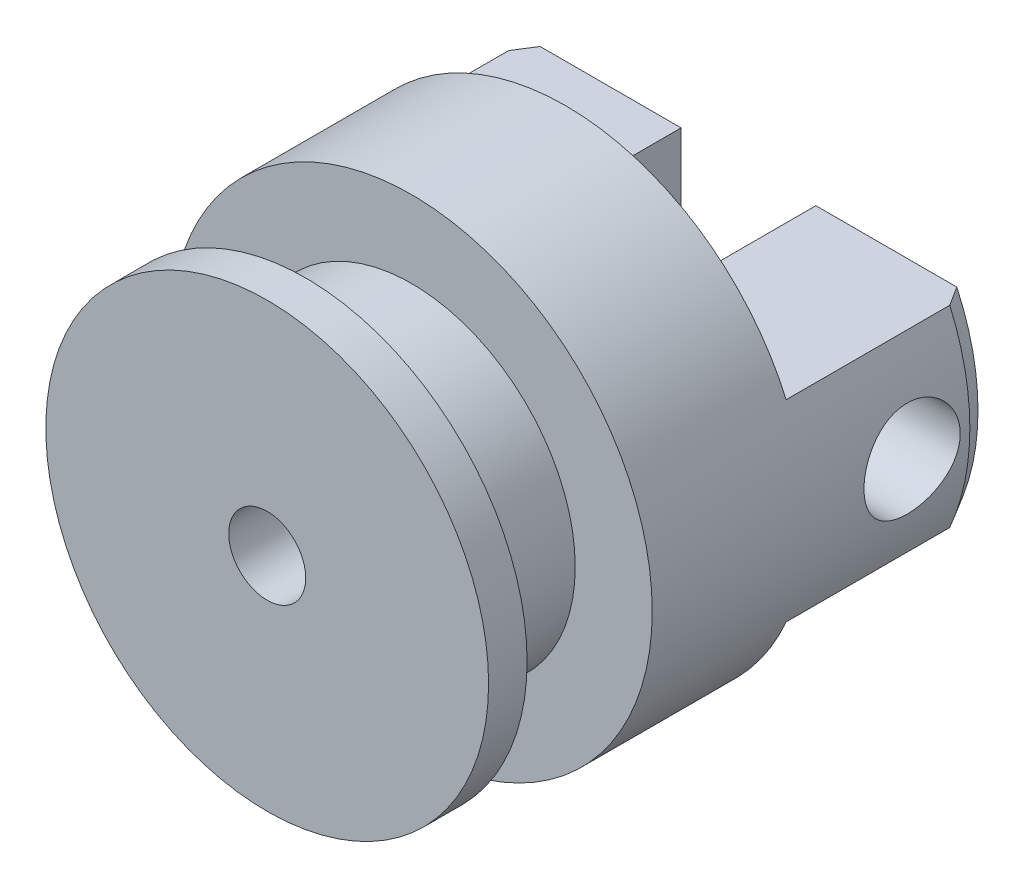
ISO-10303-21;
HEADER;
FILE_DESCRIPTION(('STEP AP214'),'2;1');
FILE_NAME('part.step','',(''),(''),'','','');
FILE_SCHEMA(('AUTOMOTIVE_DESIGN { 1 0 10303 214 1 1 1 1 }'));
ENDSEC;
DATA;
#1=APPLICATION_CONTEXT('core data for automotive mechanical design processes');
#2=APPLICATION_PROTOCOL_DEFINITION('international standard','automotive_design',2000,#1);
#3=PRODUCT_CONTEXT('',#1,'mechanical');
#4=PRODUCT('Part','Part','',(#3));
#5=PRODUCT_RELATED_PRODUCT_CATEGORY('part','',(#4));
#6=PRODUCT_DEFINITION_FORMATION('','',#4);
#7=PRODUCT_DEFINITION_CONTEXT('part definition',#1,'design');
#8=PRODUCT_DEFINITION('design','',#6,#7);
#9=PRODUCT_DEFINITION_SHAPE('','',#8);
#10=(LENGTH_UNIT() NAMED_UNIT(*) SI_UNIT(.MILLI.,.METRE.));
#11=(NAMED_UNIT(*) PLANE_ANGLE_UNIT() SI_UNIT($,.RADIAN.));
#12=(NAMED_UNIT(*) SI_UNIT($,.STERADIAN.) SOLID_ANGLE_UNIT());
#13=UNCERTAINTY_MEASURE_WITH_UNIT(LENGTH_MEASURE(1.E-05),#10,'distance_accuracy_value','');
#14=(GEOMETRIC_REPRESENTATION_CONTEXT(3) GLOBAL_UNCERTAINTY_ASSIGNED_CONTEXT((#13)) GLOBAL_UNIT_ASSIGNED_CONTEXT((#10,
#11,#12)) REPRESENTATION_CONTEXT('',''));
#15=CARTESIAN_POINT('',(0.,0.,0.));
#16=DIRECTION('',(0.,0.,1.));
#17=DIRECTION('',(1.,0.,0.));
#18=AXIS2_PLACEMENT_3D('',#15,#16,#17);
#19=CARTESIAN_POINT('',(0.,0.,-4.));
#20=DIRECTION('',(0.,0.,1.));
#21=DIRECTION('',(1.,0.,0.));
#22=AXIS2_PLACEMENT_3D('',#19,#20,#21);
#23=PLANE('',#22);
#24=DIRECTION('',(1.,0.,0.));
#25=VECTOR('',#24,1.);
#26=CARTESIAN_POINT('',(-11.4564392373896,-5.,-4.));
#27=LINE('',#26,#25);
#28=CARTESIAN_POINT('',(-10.8235657989219,-5.,-4.));
#29=VERTEX_POINT('',#28);
#30=CARTESIAN_POINT('',(-3.5,-5.,-4.));
#31=VERTEX_POINT('',#30);
#32=EDGE_CURVE('E279',#29,#31,#27,.T.);
#33=ORIENTED_EDGE('',*,*,#32,.F.);
#34=CARTESIAN_POINT('',(0.,0.,-4.));
#35=DIRECTION('',(0.,0.,1.));
#36=DIRECTION('',(1.,0.,0.));
#37=AXIS2_PLACEMENT_3D('',#34,#35,#36);
#38=CIRCLE('',#37,11.9226497308104);
#39=CARTESIAN_POINT('',(-10.8235657989219,5.,-4.));
#40=VERTEX_POINT('',#39);
#41=EDGE_CURVE('E48',#29,#40,#38,.F.);
#42=ORIENTED_EDGE('',*,*,#41,.T.);
#43=DIRECTION('',(-1.,0.,0.));
#44=VECTOR('',#43,1.);
#45=CARTESIAN_POINT('',(-11.4564392373896,5.,-4.));
#46=LINE('',#45,#44);
#47=CARTESIAN_POINT('',(-3.5,5.,-4.));
#48=VERTEX_POINT('',#47);
#49=EDGE_CURVE('E276',#48,#40,#46,.T.);
#50=ORIENTED_EDGE('',*,*,#49,.F.);
#51=DIRECTION('',(0.,1.,0.));
#52=VECTOR('',#51,1.);
#53=CARTESIAN_POINT('',(-3.5,5.,-4.));
#54=LINE('',#53,#52);
#55=EDGE_CURVE('E273',#31,#48,#54,.T.);
#56=ORIENTED_EDGE('',*,*,#55,.F.);
#57=EDGE_LOOP('',(#33,#42,#50,#56));
#58=FACE_BOUND('',#57,.T.);
#59=ADVANCED_FACE('F34',(#58),#23,.F.);
#60=DIRECTION('',(-1.,0.,0.));
#61=VECTOR('',#60,1.);
#62=CARTESIAN_POINT('',(3.5,5.,-4.));
#63=LINE('',#62,#61);
#64=CARTESIAN_POINT('',(10.8235657989219,5.,-4.));
#65=VERTEX_POINT('',#64);
#66=CARTESIAN_POINT('',(3.5,5.,-4.));
#67=VERTEX_POINT('',#66);
#68=EDGE_CURVE('E330',#65,#67,#63,.T.);
#69=ORIENTED_EDGE('',*,*,#68,.F.);
#70=CARTESIAN_POINT('',(0.,0.,-4.));
#71=DIRECTION('',(0.,0.,1.));
#72=DIRECTION('',(1.,0.,0.));
#73=AXIS2_PLACEMENT_3D('',#70,#71,#72);
#74=CIRCLE('',#73,11.9226497308104);
#75=CARTESIAN_POINT('',(10.8235657989219,-5.,-4.));
#76=VERTEX_POINT('',#75);
#77=EDGE_CURVE('E179',#65,#76,#74,.F.);
#78=ORIENTED_EDGE('',*,*,#77,.T.);
#79=DIRECTION('',(1.,0.,0.));
#80=VECTOR('',#79,1.);
#81=CARTESIAN_POINT('',(3.5,-5.,-4.));
#82=LINE('',#81,#80);
#83=CARTESIAN_POINT('',(3.5,-5.,-4.));
#84=VERTEX_POINT('',#83);
#85=EDGE_CURVE('E264',#84,#76,#82,.T.);
#86=ORIENTED_EDGE('',*,*,#85,.F.);
#87=DIRECTION('',(0.,-1.,0.));
#88=VECTOR('',#87,1.);
#89=CARTESIAN_POINT('',(3.5,5.,-4.));
#90=LINE('',#89,#88);
#91=EDGE_CURVE('E269',#67,#84,#90,.T.);
#92=ORIENTED_EDGE('',*,*,#91,.F.);
#93=EDGE_LOOP('',(#69,#78,#86,#92));
#94=FACE_BOUND('',#93,.T.);
#95=ADVANCED_FACE('F197',(#94),#23,.F.);
#96=CARTESIAN_POINT('',(0.,0.,21.));
#97=DIRECTION('',(0.,0.,-1.));
#98=DIRECTION('',(-1.,0.,0.));
#99=AXIS2_PLACEMENT_3D('',#96,#97,#98);
#100=CYLINDRICAL_SURFACE('',#99,12.5);
#101=CARTESIAN_POINT('',(-12.5,0.,2.5));
#102=CARTESIAN_POINT('',(-12.4999974395218,-0.138942266981583,2.49999488875414));
#103=CARTESIAN_POINT('',(-12.4976596294558,-0.277949150503806,2.48837789258089));
#104=CARTESIAN_POINT('',(-12.4885591405808,-0.552033769222548,2.44225374971189));
#105=CARTESIAN_POINT('',(-12.4817929465047,-0.687108293853389,2.40772841799623));
#106=CARTESIAN_POINT('',(-12.4645912319572,-0.949325763158282,2.31689681594803));
#107=CARTESIAN_POINT('',(-12.454159226918,-1.07647616983284,2.26061140788828));
#108=CARTESIAN_POINT('',(-12.4307599508829,-1.31951997216056,2.12791938122176));
#109=CARTESIAN_POINT('',(-12.4177928308927,-1.43541403768953,2.05151396098199));
#110=CARTESIAN_POINT('',(-12.3905541332492,-1.65423369328716,1.87965376427141));
#111=CARTESIAN_POINT('',(-12.3762686376087,-1.75698487789631,1.78397911152199));
#112=CARTESIAN_POINT('',(-12.3481045113147,-1.94509189152007,1.57676895902074));
#113=CARTESIAN_POINT('',(-12.3342259125106,-2.03044636192606,1.4652322216622));
#114=CARTESIAN_POINT('',(-12.3083110453154,-2.18207938336905,1.22820951747031));
#115=CARTESIAN_POINT('',(-12.2962926841237,-2.24817734716467,1.1026058905091));
#116=CARTESIAN_POINT('',(-12.2756567014604,-2.35826416645077,0.8417954524898));
#117=CARTESIAN_POINT('',(-12.267038744049,-2.40225520609309,0.706589591634137));
#118=CARTESIAN_POINT('',(-12.2543201313051,-2.46631324971207,0.432289090230206));
#119=CARTESIAN_POINT('',(-12.2501617526797,-2.48668624489694,0.293268639644434));
#120=CARTESIAN_POINT('',(-12.2466593765157,-2.5038803193153,0.0137254465891431));
#121=CARTESIAN_POINT('',(-12.247314886696,-2.50070380678375,-0.126797140800364));
#122=CARTESIAN_POINT('',(-12.2533137787046,-2.47113643275455,-0.403116970052509));
#123=CARTESIAN_POINT('',(-12.2585863214691,-2.44509635060976,-0.538953514068286));
#124=CARTESIAN_POINT('',(-12.273113654,-2.37109471155763,-0.804290191657506));
#125=CARTESIAN_POINT('',(-12.2823686339445,-2.3231321077517,-0.933790022297521));
#126=CARTESIAN_POINT('',(-12.3038904625102,-2.2063119591868,-1.183788154259));
#127=CARTESIAN_POINT('',(-12.3161772453426,-2.13731537808028,-1.30421969892293));
#128=CARTESIAN_POINT('',(-12.3423654693265,-1.9804839364317,-1.53192712493204));
#129=CARTESIAN_POINT('',(-12.3562670959591,-1.89264691089207,-1.63920149212789));
#130=CARTESIAN_POINT('',(-12.3844255310365,-1.69874983640146,-1.83957350614234));
#131=CARTESIAN_POINT('',(-12.3986842302726,-1.59239040303111,-1.93238141964783));
#132=CARTESIAN_POINT('',(-12.4257212178602,-1.36546256015502,-2.09888461575306));
#133=CARTESIAN_POINT('',(-12.4384994872243,-1.24489396844847,-2.17257965323395));
#134=CARTESIAN_POINT('',(-12.4611672540222,-0.992648467197301,-2.29881877306494));
#135=CARTESIAN_POINT('',(-12.4710522212068,-0.860954548963249,-2.35132973411134));
#136=CARTESIAN_POINT('',(-12.4867852246965,-0.590372441121661,-2.43340118509642));
#137=CARTESIAN_POINT('',(-12.4926337500133,-0.451485125181123,-2.46296445518407));
#138=CARTESIAN_POINT('',(-12.4995667966717,-0.172948514067875,-2.49789113448569));
#139=CARTESIAN_POINT('',(-12.5007293663117,-0.0333508208139397,-2.50365104885067));
#140=CARTESIAN_POINT('',(-12.4983762982526,0.244812335481786,-2.49187535264455));
#141=CARTESIAN_POINT('',(-12.4948609235362,0.383377856109484,-2.47434105161851));
#142=CARTESIAN_POINT('',(-12.4835958002004,0.654264149866353,-2.41680406614011));
#143=CARTESIAN_POINT('',(-12.4758844101052,0.786629870849758,-2.37700482875524));
#144=CARTESIAN_POINT('',(-12.4570888015258,1.04280906874917,-2.27629004336048));
#145=CARTESIAN_POINT('',(-12.4460043303557,1.16662190409385,-2.21537291330793));
#146=CARTESIAN_POINT('',(-12.4214977883324,1.40385293421554,-2.07329377337172));
#147=CARTESIAN_POINT('',(-12.4080487609263,1.51712531688047,-1.99189304740264));
#148=CARTESIAN_POINT('',(-12.3803683707471,1.72854504779802,-1.8114770219818));
#149=CARTESIAN_POINT('',(-12.3661369242097,1.82669077232691,-1.71245983400033));
#150=CARTESIAN_POINT('',(-12.3382325889241,2.00660147693544,-1.49781662027219));
#151=CARTESIAN_POINT('',(-12.3245715058326,2.08809425612164,-1.38196063944666));
#152=CARTESIAN_POINT('',(-12.2996047949049,2.23046355012801,-1.1379715966083));
#153=CARTESIAN_POINT('',(-12.2882990728336,2.29134088980726,-1.00983902606612));
#154=CARTESIAN_POINT('',(-12.2694185146096,2.3903796039549,-0.745579384626128));
#155=CARTESIAN_POINT('',(-12.2618243718047,2.42865874947763,-0.609497896974201));
#156=CARTESIAN_POINT('',(-12.2511859198006,2.48177162906799,-0.332666366272737));
#157=CARTESIAN_POINT('',(-12.2481410172778,2.49660842056278,-0.191916934476631));
#158=CARTESIAN_POINT('',(-12.2469787407845,2.50230227716867,0.087522161360797));
#159=CARTESIAN_POINT('',(-12.2487729797325,2.49358947017724,0.226202872317524));
#160=CARTESIAN_POINT('',(-12.2568893371153,2.45338076025015,0.500079124762566));
#161=CARTESIAN_POINT('',(-12.2632114191792,2.42188504032325,0.635274694237012));
#162=CARTESIAN_POINT('',(-12.279631605479,2.33719642124739,0.898069278101363));
#163=CARTESIAN_POINT('',(-12.2897205254708,2.28405626679336,1.02568590125604));
#164=CARTESIAN_POINT('',(-12.3125428743543,2.15763661150401,1.2702593018361));
#165=CARTESIAN_POINT('',(-12.3252765249724,2.08435542193721,1.38721518431284));
#166=CARTESIAN_POINT('',(-12.3522240130806,1.91826478696603,1.60928893037579));
#167=CARTESIAN_POINT('',(-12.3664593227425,1.82514471808795,1.71417191316899));
#168=CARTESIAN_POINT('',(-12.3946520467989,1.62266092253285,1.90696551382293));
#169=CARTESIAN_POINT('',(-12.4086093965796,1.51329346788334,1.99487222579318));
#170=CARTESIAN_POINT('',(-12.4348458096993,1.28004407272062,2.15208660986612));
#171=CARTESIAN_POINT('',(-12.4471057804812,1.15602221107459,2.22119000820006));
#172=CARTESIAN_POINT('',(-12.468378127125,0.897915902351831,2.33746530649148));
#173=CARTESIAN_POINT('',(-12.4773934284654,0.763840652157815,2.38465697383123));
#174=CARTESIAN_POINT('',(-12.4894093148843,0.524553722309448,2.44662987011179));
#175=CARTESIAN_POINT('',(-12.4933575789613,0.420704160034461,2.46660798426939));
#176=CARTESIAN_POINT('',(-12.4986538534973,0.211248813025167,2.49329478089591));
#177=CARTESIAN_POINT('',(-12.5000019468289,0.105643084371547,2.50000388627442));
#178=CARTESIAN_POINT('',(-12.5,0.,2.5));
#179=B_SPLINE_CURVE_WITH_KNOTS('',3,(#101,#102,#103,#104,#105,#106,#107,#108,#109,#110,#111,
#112,#113,#114,#115,#116,#117,#118,#119,#120,#121,#122,#123,#124,#125,#126,#127,#128,#129,#130,
#131,#132,#133,#134,#135,#136,#137,#138,#139,#140,#141,#142,#143,#144,#145,#146,#147,#148,#149,
#150,#151,#152,#153,#154,#155,#156,#157,#158,#159,#160,#161,#162,#163,#164,#165,#166,#167,#168,
#169,#170,#171,#172,#173,#174,#175,#176,#177,#178),.UNSPECIFIED.,.T.,.F.,(4,2,2,2,2,2,2,2,2,2,2,
2,2,2,2,2,2,2,2,2,2,2,2,2,2,2,2,2,2,2,2,2,2,2,2,2,2,2,4),(0.,0.416440326653146,
0.833211626728308,1.24958433812585,1.66593225557716,2.08733167528047,2.50876399186842,
2.93402987514807,3.35925373412994,3.77890462758968,4.19851260703063,4.61179317515696,
5.02509348134324,5.44118725508982,5.85732886874176,6.28095631228377,6.70458918849551,
7.1288818713506,7.5531231424509,7.97026839190663,8.38739019144669,8.80076134876808,
9.21416348040056,9.63262665083396,10.0511347086483,10.4760157144806,10.9008797180867,
11.3235095258181,11.7460842082604,12.1609930641925,12.5758985873152,12.9897990313277,
13.4037341895467,13.8247019059786,14.2457663633233,14.6712374168909,15.096323887938,
15.4129693822473,15.7296047842749),.UNSPECIFIED.);
#180=CARTESIAN_POINT('',(-12.5,0.,2.5));
#181=VERTEX_POINT('',#180);
#182=EDGE_CURVE('E144',#181,#181,#179,.T.);
#183=ORIENTED_EDGE('',*,*,#182,.T.);
#184=EDGE_LOOP('',(#183));
#185=FACE_BOUND('',#184,.T.);
#186=CARTESIAN_POINT('',(12.5,0.,-2.5));
#187=CARTESIAN_POINT('',(12.4999974395218,-0.138942266981583,-2.49999488875414));
#188=CARTESIAN_POINT('',(12.4976596294558,-0.277949150503806,-2.48837789258089));
#189=CARTESIAN_POINT('',(12.4885591405808,-0.552033769222548,-2.44225374971189));
#190=CARTESIAN_POINT('',(12.4817929465047,-0.687108293853389,-2.40772841799623));
#191=CARTESIAN_POINT('',(12.4645912319572,-0.949325763158282,-2.31689681594803));
#192=CARTESIAN_POINT('',(12.454159226918,-1.07647616983284,-2.26061140788828));
#193=CARTESIAN_POINT('',(12.4307599508829,-1.31951997216056,-2.12791938122176));
#194=CARTESIAN_POINT('',(12.4177928308927,-1.43541403768953,-2.05151396098199));
#195=CARTESIAN_POINT('',(12.3905541332492,-1.65423369328716,-1.87965376427141));
#196=CARTESIAN_POINT('',(12.3762686376087,-1.75698487789631,-1.78397911152199));
#197=CARTESIAN_POINT('',(12.3481045113147,-1.94509189152007,-1.57676895902074));
#198=CARTESIAN_POINT('',(12.3342259125106,-2.03044636192606,-1.4652322216622));
#199=CARTESIAN_POINT('',(12.3083110453154,-2.18207938336905,-1.22820951747031));
#200=CARTESIAN_POINT('',(12.2962926841237,-2.24817734716467,-1.1026058905091));
#201=CARTESIAN_POINT('',(12.2756567014604,-2.35826416645077,-0.841795452489801));
#202=CARTESIAN_POINT('',(12.267038744049,-2.40225520609309,-0.706589591634138));
#203=CARTESIAN_POINT('',(12.2543201313051,-2.46631324971207,-0.432289090230207));
#204=CARTESIAN_POINT('',(12.2501617526797,-2.48668624489694,-0.293268639644435));
#205=CARTESIAN_POINT('',(12.2466593765157,-2.5038803193153,-0.0137254465891446));
#206=CARTESIAN_POINT('',(12.247314886696,-2.50070380678375,0.126797140800363));
#207=CARTESIAN_POINT('',(12.2533137787046,-2.47113643275455,0.403116970052507));
#208=CARTESIAN_POINT('',(12.2585863214691,-2.44509635060976,0.538953514068285));
#209=CARTESIAN_POINT('',(12.273113654,-2.37109471155763,0.804290191657505));
#210=CARTESIAN_POINT('',(12.2823686339445,-2.3231321077517,0.933790022297519));
#211=CARTESIAN_POINT('',(12.3038904625102,-2.2063119591868,1.183788154259));
#212=CARTESIAN_POINT('',(12.3161772453426,-2.13731537808029,1.30421969892293));
#213=CARTESIAN_POINT('',(12.3423654693265,-1.9804839364317,1.53192712493203));
#214=CARTESIAN_POINT('',(12.3562670959591,-1.89264691089207,1.63920149212789));
#215=CARTESIAN_POINT('',(12.3844255310365,-1.69874983640146,1.83957350614234));
#216=CARTESIAN_POINT('',(12.3986842302726,-1.59239040303111,1.93238141964782));
#217=CARTESIAN_POINT('',(12.4257212178602,-1.36546256015503,2.09888461575306));
#218=CARTESIAN_POINT('',(12.4384994872243,-1.24489396844847,2.17257965323395));
#219=CARTESIAN_POINT('',(12.4611672540222,-0.992648467197303,2.29881877306494));
#220=CARTESIAN_POINT('',(12.4710522212068,-0.860954548963251,2.35132973411134));
#221=CARTESIAN_POINT('',(12.4867852246965,-0.590372441121663,2.43340118509642));
#222=CARTESIAN_POINT('',(12.4926337500133,-0.451485125181124,2.46296445518407));
#223=CARTESIAN_POINT('',(12.4995667966717,-0.172948514067876,2.49789113448569));
#224=CARTESIAN_POINT('',(12.5007293663117,-0.0333508208139405,2.50365104885067));
#225=CARTESIAN_POINT('',(12.4983762982526,0.244812335481785,2.49187535264455));
#226=CARTESIAN_POINT('',(12.4948609235362,0.383377856109483,2.47434105161851));
#227=CARTESIAN_POINT('',(12.4835958002004,0.654264149866352,2.41680406614011));
#228=CARTESIAN_POINT('',(12.4758844101052,0.786629870849757,2.37700482875524));
#229=CARTESIAN_POINT('',(12.4570888015258,1.04280906874917,2.27629004336048));
#230=CARTESIAN_POINT('',(12.4460043303557,1.16662190409385,2.21537291330793));
#231=CARTESIAN_POINT('',(12.4214977883324,1.40385293421554,2.07329377337172));
#232=CARTESIAN_POINT('',(12.4080487609263,1.51712531688047,1.99189304740264));
#233=CARTESIAN_POINT('',(12.3803683707471,1.72854504779802,1.8114770219818));
#234=CARTESIAN_POINT('',(12.3661369242097,1.82669077232691,1.71245983400033));
#235=CARTESIAN_POINT('',(12.3382325889241,2.00660147693544,1.49781662027219));
#236=CARTESIAN_POINT('',(12.3245715058326,2.08809425612164,1.38196063944666));
#237=CARTESIAN_POINT('',(12.2996047949049,2.23046355012801,1.1379715966083));
#238=CARTESIAN_POINT('',(12.2882990728336,2.29134088980726,1.00983902606612));
#239=CARTESIAN_POINT('',(12.2694185146096,2.3903796039549,0.74557938462613));
#240=CARTESIAN_POINT('',(12.2618243718047,2.42865874947763,0.609497896974205));
#241=CARTESIAN_POINT('',(12.2511859198006,2.48177162906799,0.332666366272739));
#242=CARTESIAN_POINT('',(12.2481410172778,2.49660842056278,0.191916934476633));
#243=CARTESIAN_POINT('',(12.2469787407845,2.50230227716867,-0.0875221613607955));
#244=CARTESIAN_POINT('',(12.2487729797325,2.49358947017724,-0.226202872317522));
#245=CARTESIAN_POINT('',(12.2568893371153,2.45338076025015,-0.500079124762565));
#246=CARTESIAN_POINT('',(12.2632114191792,2.42188504032325,-0.635274694237011));
#247=CARTESIAN_POINT('',(12.279631605479,2.33719642124739,-0.898069278101361));
#248=CARTESIAN_POINT('',(12.2897205254708,2.28405626679336,-1.02568590125604));
#249=CARTESIAN_POINT('',(12.3125428743543,2.15763661150401,-1.2702593018361));
#250=CARTESIAN_POINT('',(12.3252765249723,2.08435542193721,-1.38721518431284));
#251=CARTESIAN_POINT('',(12.3522240130806,1.91826478696604,-1.60928893037578));
#252=CARTESIAN_POINT('',(12.3664593227425,1.82514471808795,-1.71417191316899));
#253=CARTESIAN_POINT('',(12.3946520467989,1.62266092253285,-1.90696551382293));
#254=CARTESIAN_POINT('',(12.4086093965796,1.51329346788334,-1.99487222579318));
#255=CARTESIAN_POINT('',(12.4348458096993,1.28004407272062,-2.15208660986612));
#256=CARTESIAN_POINT('',(12.4471057804812,1.15602221107459,-2.22119000820006));
#257=CARTESIAN_POINT('',(12.468378127125,0.897915902351832,-2.33746530649148));
#258=CARTESIAN_POINT('',(12.4773934284654,0.763840652157816,-2.38465697383123));
#259=CARTESIAN_POINT('',(12.4894093148843,0.524553722309449,-2.44662987011179));
#260=CARTESIAN_POINT('',(12.4933575789613,0.420704160034462,-2.46660798426939));
#261=CARTESIAN_POINT('',(12.4986538534973,0.211248813025167,-2.49329478089591));
#262=CARTESIAN_POINT('',(12.5000019468289,0.105643084371548,-2.50000388627442));
#263=CARTESIAN_POINT('',(12.5,0.,-2.5));
#264=B_SPLINE_CURVE_WITH_KNOTS('',3,(#186,#187,#188,#189,#190,#191,#192,#193,#194,#195,#196,
#197,#198,#199,#200,#201,#202,#203,#204,#205,#206,#207,#208,#209,#210,#211,#212,#213,#214,#215,
#216,#217,#218,#219,#220,#221,#222,#223,#224,#225,#226,#227,#228,#229,#230,#231,#232,#233,#234,
#235,#236,#237,#238,#239,#240,#241,#242,#243,#244,#245,#246,#247,#248,#249,#250,#251,#252,#253,
#254,#255,#256,#257,#258,#259,#260,#261,#262,#263),.UNSPECIFIED.,.T.,.F.,(4,2,2,2,2,2,2,2,2,2,2,
2,2,2,2,2,2,2,2,2,2,2,2,2,2,2,2,2,2,2,2,2,2,2,2,2,2,2,4),(0.,0.416440326653146,
0.833211626728308,1.24958433812585,1.66593225557716,2.08733167528047,2.50876399186841,
2.93402987514807,3.35925373412994,3.77890462758968,4.19851260703063,4.61179317515696,
5.02509348134324,5.44118725508981,5.85732886874176,6.28095631228377,6.7045891884955,
7.1288818713506,7.5531231424509,7.97026839190663,8.38739019144669,8.80076134876809,
9.21416348040056,9.63262665083397,10.0511347086483,10.4760157144806,10.9008797180867,
11.3235095258181,11.7460842082604,12.1609930641925,12.5758985873152,12.9897990313278,
13.4037341895467,13.8247019059786,14.2457663633233,14.6712374168909,15.096323887938,
15.4129693822474,15.7296047842749),.UNSPECIFIED.);
#265=CARTESIAN_POINT('',(12.5,0.,-2.5));
#266=VERTEX_POINT('',#265);
#267=EDGE_CURVE('E138',#266,#266,#264,.T.);
#268=ORIENTED_EDGE('',*,*,#267,.T.);
#269=EDGE_LOOP('',(#268));
#270=FACE_BOUND('',#269,.T.);
#271=DIRECTION('',(0.,0.,1.));
#272=VECTOR('',#271,1.);
#273=CARTESIAN_POINT('',(11.4564392373896,-5.,-4.));
#274=LINE('',#273,#272);
#275=CARTESIAN_POINT('',(11.4564392373896,-5.,-2.99999999999999));
#276=VERTEX_POINT('',#275);
#277=CARTESIAN_POINT('',(11.4564392373896,-5.,5.5));
#278=VERTEX_POINT('',#277);
#279=EDGE_CURVE('E277',#276,#278,#274,.T.);
#280=ORIENTED_EDGE('',*,*,#279,.F.);
#281=CARTESIAN_POINT('',(0.,0.,-3.));
#282=DIRECTION('',(0.,0.,1.));
#283=DIRECTION('',(1.,0.,0.));
#284=AXIS2_PLACEMENT_3D('',#281,#282,#283);
#285=CIRCLE('',#284,12.5);
#286=CARTESIAN_POINT('',(11.4564392373896,5.,-2.99999999999999));
#287=VERTEX_POINT('',#286);
#288=EDGE_CURVE('E239',#276,#287,#285,.T.);
#289=ORIENTED_EDGE('',*,*,#288,.T.);
#290=DIRECTION('',(0.,0.,1.));
#291=VECTOR('',#290,1.);
#292=CARTESIAN_POINT('',(11.4564392373896,5.,-4.));
#293=LINE('',#292,#291);
#294=CARTESIAN_POINT('',(11.4564392373896,5.,5.5));
#295=VERTEX_POINT('',#294);
#296=EDGE_CURVE('E257',#287,#295,#293,.T.);
#297=ORIENTED_EDGE('',*,*,#296,.T.);
#298=CARTESIAN_POINT('',(0.,0.,5.5));
#299=DIRECTION('',(0.,0.,1.));
#300=DIRECTION('',(1.,0.,0.));
#301=AXIS2_PLACEMENT_3D('',#298,#299,#300);
#302=CIRCLE('',#301,12.5);
#303=CARTESIAN_POINT('',(-11.4564392373896,5.,5.5));
#304=VERTEX_POINT('',#303);
#305=EDGE_CURVE('E227',#295,#304,#302,.T.);
#306=ORIENTED_EDGE('',*,*,#305,.T.);
#307=DIRECTION('',(0.,0.,1.));
#308=VECTOR('',#307,1.);
#309=CARTESIAN_POINT('',(-11.4564392373896,5.,-4.));
#310=LINE('',#309,#308);
#311=CARTESIAN_POINT('',(-11.4564392373896,5.,-3.));
#312=VERTEX_POINT('',#311);
#313=EDGE_CURVE('E287',#312,#304,#310,.T.);
#314=ORIENTED_EDGE('',*,*,#313,.F.);
#315=CARTESIAN_POINT('',(0.,0.,-3.));
#316=DIRECTION('',(0.,0.,1.));
#317=DIRECTION('',(1.,0.,0.));
#318=AXIS2_PLACEMENT_3D('',#315,#316,#317);
#319=CIRCLE('',#318,12.5);
#320=CARTESIAN_POINT('',(-11.4564392373896,-5.,-3.));
#321=VERTEX_POINT('',#320);
#322=EDGE_CURVE('E235',#312,#321,#319,.T.);
#323=ORIENTED_EDGE('',*,*,#322,.T.);
#324=DIRECTION('',(0.,0.,1.));
#325=VECTOR('',#324,1.);
#326=CARTESIAN_POINT('',(-11.4564392373896,-5.,-4.));
#327=LINE('',#326,#325);
#328=CARTESIAN_POINT('',(-11.4564392373896,-5.,5.5));
#329=VERTEX_POINT('',#328);
#330=EDGE_CURVE('E285',#321,#329,#327,.T.);
#331=ORIENTED_EDGE('',*,*,#330,.T.);
#332=EDGE_CURVE('E223',#329,#278,#302,.T.);
#333=ORIENTED_EDGE('',*,*,#332,.T.);
#334=EDGE_LOOP('',(#280,#289,#297,#306,#314,#323,#331,#333));
#335=FACE_BOUND('',#334,.T.);
#336=CARTESIAN_POINT('',(0.,0.,13.5));
#337=DIRECTION('',(0.,0.,1.));
#338=DIRECTION('',(1.,0.,0.));
#339=AXIS2_PLACEMENT_3D('',#336,#337,#338);
#340=CIRCLE('',#339,12.5);
#341=CARTESIAN_POINT('',(12.5,0.,13.5));
#342=VERTEX_POINT('',#341);
#343=EDGE_CURVE('E224',#342,#342,#340,.T.);
#344=ORIENTED_EDGE('',*,*,#343,.F.);
#345=EDGE_LOOP('',(#344));
#346=FACE_BOUND('',#345,.T.);
#347=ADVANCED_FACE('F36',(#185,#270,#335,#346),#100,.T.);
#348=CARTESIAN_POINT('',(0.,0.,13.5));
#349=DIRECTION('',(0.,0.,1.));
#350=DIRECTION('',(1.,0.,0.));
#351=AXIS2_PLACEMENT_3D('',#348,#349,#350);
#352=PLANE('',#351);
#353=CARTESIAN_POINT('',(0.,0.,13.5));
#354=DIRECTION('',(0.,0.,1.));
#355=DIRECTION('',(1.,0.,0.));
#356=AXIS2_PLACEMENT_3D('',#353,#354,#355);
#357=CIRCLE('',#356,8.5);
#358=CARTESIAN_POINT('',(8.5,0.,13.5));
#359=VERTEX_POINT('',#358);
#360=EDGE_CURVE('E291',#359,#359,#357,.T.);
#361=ORIENTED_EDGE('',*,*,#360,.F.);
#362=EDGE_LOOP('',(#361));
#363=FACE_BOUND('',#362,.T.);
#364=ORIENTED_EDGE('',*,*,#343,.T.);
#365=EDGE_LOOP('',(#364));
#366=FACE_BOUND('',#365,.T.);
#367=ADVANCED_FACE('F299',(#363,#366),#352,.T.);
#368=CARTESIAN_POINT('',(0.,0.,19.));
#369=DIRECTION('',(0.,0.,1.));
#370=DIRECTION('',(1.,0.,0.));
#371=AXIS2_PLACEMENT_3D('',#368,#369,#370);
#372=PLANE('',#371);
#373=CARTESIAN_POINT('',(0.,0.,19.));
#374=DIRECTION('',(0.,0.,1.));
#375=DIRECTION('',(1.,0.,0.));
#376=AXIS2_PLACEMENT_3D('',#373,#374,#375);
#377=CIRCLE('',#376,11.5);
#378=CARTESIAN_POINT('',(11.5,0.,19.));
#379=VERTEX_POINT('',#378);
#380=EDGE_CURVE('E230',#379,#379,#377,.F.);
#381=ORIENTED_EDGE('',*,*,#380,.T.);
#382=EDGE_LOOP('',(#381));
#383=FACE_BOUND('',#382,.T.);
#384=CARTESIAN_POINT('',(0.,0.,19.));
#385=DIRECTION('',(0.,0.,1.));
#386=DIRECTION('',(1.,0.,0.));
#387=AXIS2_PLACEMENT_3D('',#384,#385,#386);
#388=CIRCLE('',#387,8.5);
#389=CARTESIAN_POINT('',(8.5,0.,19.));
#390=VERTEX_POINT('',#389);
#391=EDGE_CURVE('E284',#390,#390,#388,.T.);
#392=ORIENTED_EDGE('',*,*,#391,.T.);
#393=EDGE_LOOP('',(#392));
#394=FACE_BOUND('',#393,.T.);
#395=ADVANCED_FACE('F214',(#383,#394),#372,.F.);
#396=CARTESIAN_POINT('',(0.,0.,13.5));
#397=DIRECTION('',(0.,0.,1.));
#398=DIRECTION('',(1.,0.,0.));
#399=AXIS2_PLACEMENT_3D('',#396,#397,#398);
#400=CYLINDRICAL_SURFACE('',#399,8.5);
#401=ORIENTED_EDGE('',*,*,#360,.T.);
#402=EDGE_LOOP('',(#401));
#403=FACE_BOUND('',#402,.T.);
#404=ORIENTED_EDGE('',*,*,#391,.F.);
#405=EDGE_LOOP('',(#404));
#406=FACE_BOUND('',#405,.T.);
#407=ADVANCED_FACE('F207',(#403,#406),#400,.T.);
#408=CARTESIAN_POINT('',(0.,0.,21.));
#409=DIRECTION('',(0.,0.,1.));
#410=DIRECTION('',(1.,0.,0.));
#411=AXIS2_PLACEMENT_3D('',#408,#409,#410);
#412=PLANE('',#411);
#413=CARTESIAN_POINT('',(0.,0.,21.));
#414=DIRECTION('',(0.,0.,1.));
#415=DIRECTION('',(1.,0.,0.));
#416=AXIS2_PLACEMENT_3D('',#413,#414,#415);
#417=CIRCLE('',#416,2.);
#418=CARTESIAN_POINT('',(2.,0.,21.));
#419=VERTEX_POINT('',#418);
#420=EDGE_CURVE('E128',#419,#419,#417,.T.);
#421=ORIENTED_EDGE('',*,*,#420,.F.);
#422=EDGE_LOOP('',(#421));
#423=FACE_BOUND('',#422,.T.);
#424=CARTESIAN_POINT('',(0.,0.,21.));
#425=DIRECTION('',(0.,0.,1.));
#426=DIRECTION('',(1.,0.,0.));
#427=AXIS2_PLACEMENT_3D('',#424,#425,#426);
#428=CIRCLE('',#427,11.5);
#429=CARTESIAN_POINT('',(11.5,0.,21.));
#430=VERTEX_POINT('',#429);
#431=EDGE_CURVE('E221',#430,#430,#428,.T.);
#432=ORIENTED_EDGE('',*,*,#431,.T.);
#433=EDGE_LOOP('',(#432));
#434=FACE_BOUND('',#433,.T.);
#435=ADVANCED_FACE('F205',(#423,#434),#412,.T.);
#436=CARTESIAN_POINT('',(0.,0.,19.));
#437=DIRECTION('',(0.,0.,1.));
#438=DIRECTION('',(1.,0.,0.));
#439=AXIS2_PLACEMENT_3D('',#436,#437,#438);
#440=CYLINDRICAL_SURFACE('',#439,11.5);
#441=ORIENTED_EDGE('',*,*,#380,.F.);
#442=EDGE_LOOP('',(#441));
#443=FACE_BOUND('',#442,.T.);
#444=ORIENTED_EDGE('',*,*,#431,.F.);
#445=EDGE_LOOP('',(#444));
#446=FACE_BOUND('',#445,.T.);
#447=ADVANCED_FACE('F162',(#443,#446),#440,.T.);
#448=CARTESIAN_POINT('',(0.,0.,5.5));
#449=DIRECTION('',(0.,0.,1.));
#450=DIRECTION('',(1.,0.,0.));
#451=AXIS2_PLACEMENT_3D('',#448,#449,#450);
#452=PLANE('',#451);
#453=DIRECTION('',(-1.,0.,0.));
#454=VECTOR('',#453,1.);
#455=CARTESIAN_POINT('',(3.5,5.,5.5));
#456=LINE('',#455,#454);
#457=CARTESIAN_POINT('',(3.5,5.,5.5));
#458=VERTEX_POINT('',#457);
#459=EDGE_CURVE('E260',#295,#458,#456,.T.);
#460=ORIENTED_EDGE('',*,*,#459,.T.);
#461=DIRECTION('',(0.,-1.,0.));
#462=VECTOR('',#461,1.);
#463=CARTESIAN_POINT('',(3.5,5.,5.5));
#464=LINE('',#463,#462);
#465=CARTESIAN_POINT('',(3.5,-5.,5.5));
#466=VERTEX_POINT('',#465);
#467=EDGE_CURVE('E345',#458,#466,#464,.T.);
#468=ORIENTED_EDGE('',*,*,#467,.T.);
#469=DIRECTION('',(1.,0.,0.));
#470=VECTOR('',#469,1.);
#471=CARTESIAN_POINT('',(3.5,-5.,5.5));
#472=LINE('',#471,#470);
#473=EDGE_CURVE('E350',#466,#278,#472,.T.);
#474=ORIENTED_EDGE('',*,*,#473,.T.);
#475=ORIENTED_EDGE('',*,*,#332,.F.);
#476=DIRECTION('',(1.,0.,0.));
#477=VECTOR('',#476,1.);
#478=CARTESIAN_POINT('',(-11.4564392373896,-5.,5.5));
#479=LINE('',#478,#477);
#480=CARTESIAN_POINT('',(-3.5,-5.,5.5));
#481=VERTEX_POINT('',#480);
#482=EDGE_CURVE('E326',#329,#481,#479,.T.);
#483=ORIENTED_EDGE('',*,*,#482,.T.);
#484=DIRECTION('',(0.,1.,0.));
#485=VECTOR('',#484,1.);
#486=CARTESIAN_POINT('',(-3.5,5.,5.5));
#487=LINE('',#486,#485);
#488=CARTESIAN_POINT('',(-3.5,5.,5.5));
#489=VERTEX_POINT('',#488);
#490=EDGE_CURVE('E335',#481,#489,#487,.T.);
#491=ORIENTED_EDGE('',*,*,#490,.T.);
#492=DIRECTION('',(-1.,0.,0.));
#493=VECTOR('',#492,1.);
#494=CARTESIAN_POINT('',(-11.4564392373896,5.,5.5));
#495=LINE('',#494,#493);
#496=EDGE_CURVE('E331',#489,#304,#495,.T.);
#497=ORIENTED_EDGE('',*,*,#496,.T.);
#498=ORIENTED_EDGE('',*,*,#305,.F.);
#499=EDGE_LOOP('',(#460,#468,#474,#475,#483,#491,#497,#498));
#500=FACE_BOUND('',#499,.T.);
#501=ADVANCED_FACE('F157',(#500),#452,.F.);
#502=CARTESIAN_POINT('',(-3.5,5.,-4.));
#503=DIRECTION('',(1.,0.,0.));
#504=DIRECTION('',(0.,0.,-1.));
#505=AXIS2_PLACEMENT_3D('',#502,#503,#504);
#506=PLANE('',#505);
#507=CARTESIAN_POINT('',(-3.5,0.,0.));
#508=DIRECTION('',(1.,0.,0.));
#509=DIRECTION('',(0.,0.,-1.));
#510=AXIS2_PLACEMENT_3D('',#507,#508,#509);
#511=CIRCLE('',#510,2.5);
#512=CARTESIAN_POINT('',(-3.5,0.,-2.5));
#513=VERTEX_POINT('',#512);
#514=EDGE_CURVE('E131',#513,#513,#511,.T.);
#515=ORIENTED_EDGE('',*,*,#514,.F.);
#516=EDGE_LOOP('',(#515));
#517=FACE_BOUND('',#516,.T.);
#518=DIRECTION('',(0.,0.,1.));
#519=VECTOR('',#518,1.);
#520=CARTESIAN_POINT('',(-3.5,-5.,-4.));
#521=LINE('',#520,#519);
#522=EDGE_CURVE('E282',#31,#481,#521,.T.);
#523=ORIENTED_EDGE('',*,*,#522,.F.);
#524=ORIENTED_EDGE('',*,*,#55,.T.);
#525=DIRECTION('',(0.,0.,1.));
#526=VECTOR('',#525,1.);
#527=CARTESIAN_POINT('',(-3.5,5.,-4.));
#528=LINE('',#527,#526);
#529=EDGE_CURVE('E281',#48,#489,#528,.T.);
#530=ORIENTED_EDGE('',*,*,#529,.T.);
#531=ORIENTED_EDGE('',*,*,#490,.F.);
#532=EDGE_LOOP('',(#523,#524,#530,#531));
#533=FACE_BOUND('',#532,.T.);
#534=ADVANCED_FACE('F161',(#517,#533),#506,.T.);
#535=CARTESIAN_POINT('',(-11.4564392373896,-5.,-4.));
#536=DIRECTION('',(0.,-1.,0.));
#537=DIRECTION('',(1.,0.,0.));
#538=AXIS2_PLACEMENT_3D('',#535,#536,#537);
#539=PLANE('',#538);
#540=ORIENTED_EDGE('',*,*,#330,.F.);
#541=CARTESIAN_POINT('',(-11.4564392373896,-5.,-3.));
#542=CARTESIAN_POINT('',(-11.3513192349977,-5.,-3.16689380109005));
#543=CARTESIAN_POINT('',(-11.2460197820464,-5.,-3.33367403268759));
#544=CARTESIAN_POINT('',(-11.0350619692436,-5.,-3.66700736603337));
#545=CARTESIAN_POINT('',(-10.9294036093722,-5.,-3.83356046776917));
#546=CARTESIAN_POINT('',(-10.8235657989219,-5.,-4.));
#547=B_SPLINE_CURVE_WITH_KNOTS('',3,(#541,#542,#543,#544,#545,#546),.UNSPECIFIED.,.F.,.F.,(4,2,
4),(0.,0.591720021625132,1.18344007568498),.UNSPECIFIED.);
#548=EDGE_CURVE('E62',#321,#29,#547,.T.);
#549=ORIENTED_EDGE('',*,*,#548,.T.);
#550=ORIENTED_EDGE('',*,*,#32,.T.);
#551=ORIENTED_EDGE('',*,*,#522,.T.);
#552=ORIENTED_EDGE('',*,*,#482,.F.);
#553=EDGE_LOOP('',(#540,#549,#550,#551,#552));
#554=FACE_BOUND('',#553,.T.);
#555=ADVANCED_FACE('F185',(#554),#539,.T.);
#556=CARTESIAN_POINT('',(-11.4564392373896,5.,-4.));
#557=DIRECTION('',(0.,1.,0.));
#558=DIRECTION('',(-1.,0.,0.));
#559=AXIS2_PLACEMENT_3D('',#556,#557,#558);
#560=PLANE('',#559);
#561=ORIENTED_EDGE('',*,*,#49,.T.);
#562=CARTESIAN_POINT('',(-10.8235657989219,5.,-4.));
#563=CARTESIAN_POINT('',(-10.9294036093722,5.,-3.83356046776917));
#564=CARTESIAN_POINT('',(-11.0350619692436,5.,-3.66700736603337));
#565=CARTESIAN_POINT('',(-11.2460197820464,5.,-3.33367403268759));
#566=CARTESIAN_POINT('',(-11.3513192349977,5.,-3.16689380109005));
#567=CARTESIAN_POINT('',(-11.4564392373896,5.,-3.));
#568=B_SPLINE_CURVE_WITH_KNOTS('',3,(#562,#563,#564,#565,#566,#567),.UNSPECIFIED.,.F.,.F.,(4,2,
4),(0.,0.591720054059845,1.18344007568498),.UNSPECIFIED.);
#569=EDGE_CURVE('E11',#40,#312,#568,.T.);
#570=ORIENTED_EDGE('',*,*,#569,.T.);
#571=ORIENTED_EDGE('',*,*,#313,.T.);
#572=ORIENTED_EDGE('',*,*,#496,.F.);
#573=ORIENTED_EDGE('',*,*,#529,.F.);
#574=EDGE_LOOP('',(#561,#570,#571,#572,#573));
#575=FACE_BOUND('',#574,.T.);
#576=ADVANCED_FACE('F169',(#575),#560,.T.);
#577=CARTESIAN_POINT('',(3.5,-5.,-4.));
#578=DIRECTION('',(0.,-1.,0.));
#579=DIRECTION('',(1.,0.,0.));
#580=AXIS2_PLACEMENT_3D('',#577,#578,#579);
#581=PLANE('',#580);
#582=ORIENTED_EDGE('',*,*,#85,.T.);
#583=CARTESIAN_POINT('',(10.8235657989219,-5.,-4.));
#584=CARTESIAN_POINT('',(10.9294036093722,-5.,-3.83356046776917));
#585=CARTESIAN_POINT('',(11.0350619692436,-5.,-3.66700736603337));
#586=CARTESIAN_POINT('',(11.2460197820464,-5.,-3.33367403268759));
#587=CARTESIAN_POINT('',(11.3513192349977,-5.,-3.16689380109005));
#588=CARTESIAN_POINT('',(11.4564392373896,-5.,-3.));
#589=B_SPLINE_CURVE_WITH_KNOTS('',3,(#583,#584,#585,#586,#587,#588),.UNSPECIFIED.,.F.,.F.,(4,2,
4),(0.,0.591720054059847,1.18344007568498),.UNSPECIFIED.);
#590=EDGE_CURVE('E173',#76,#276,#589,.T.);
#591=ORIENTED_EDGE('',*,*,#590,.T.);
#592=ORIENTED_EDGE('',*,*,#279,.T.);
#593=ORIENTED_EDGE('',*,*,#473,.F.);
#594=DIRECTION('',(0.,0.,1.));
#595=VECTOR('',#594,1.);
#596=CARTESIAN_POINT('',(3.5,-5.,-4.));
#597=LINE('',#596,#595);
#598=EDGE_CURVE('E266',#84,#466,#597,.T.);
#599=ORIENTED_EDGE('',*,*,#598,.F.);
#600=EDGE_LOOP('',(#582,#591,#592,#593,#599));
#601=FACE_BOUND('',#600,.T.);
#602=ADVANCED_FACE('F164',(#601),#581,.T.);
#603=CARTESIAN_POINT('',(3.5,5.,-4.));
#604=DIRECTION('',(-1.,0.,0.));
#605=DIRECTION('',(0.,0.,1.));
#606=AXIS2_PLACEMENT_3D('',#603,#604,#605);
#607=PLANE('',#606);
#608=CARTESIAN_POINT('',(3.50000000000001,0.,0.));
#609=DIRECTION('',(-1.,0.,0.));
#610=DIRECTION('',(0.,0.,1.));
#611=AXIS2_PLACEMENT_3D('',#608,#609,#610);
#612=CIRCLE('',#611,2.5);
#613=CARTESIAN_POINT('',(3.50000000000001,0.,2.5));
#614=VERTEX_POINT('',#613);
#615=EDGE_CURVE('E127',#614,#614,#612,.T.);
#616=ORIENTED_EDGE('',*,*,#615,.F.);
#617=EDGE_LOOP('',(#616));
#618=FACE_BOUND('',#617,.T.);
#619=DIRECTION('',(0.,0.,1.));
#620=VECTOR('',#619,1.);
#621=CARTESIAN_POINT('',(3.5,5.,-4.));
#622=LINE('',#621,#620);
#623=EDGE_CURVE('E263',#67,#458,#622,.T.);
#624=ORIENTED_EDGE('',*,*,#623,.F.);
#625=ORIENTED_EDGE('',*,*,#91,.T.);
#626=ORIENTED_EDGE('',*,*,#598,.T.);
#627=ORIENTED_EDGE('',*,*,#467,.F.);
#628=EDGE_LOOP('',(#624,#625,#626,#627));
#629=FACE_BOUND('',#628,.T.);
#630=ADVANCED_FACE('F168',(#618,#629),#607,.T.);
#631=CARTESIAN_POINT('',(3.5,5.,-4.));
#632=DIRECTION('',(0.,1.,0.));
#633=DIRECTION('',(-1.,0.,0.));
#634=AXIS2_PLACEMENT_3D('',#631,#632,#633);
#635=PLANE('',#634);
#636=ORIENTED_EDGE('',*,*,#296,.F.);
#637=CARTESIAN_POINT('',(11.4564392373896,5.,-3.));
#638=CARTESIAN_POINT('',(11.3513192349977,5.,-3.16689380109005));
#639=CARTESIAN_POINT('',(11.2460197820464,5.,-3.33367403268759));
#640=CARTESIAN_POINT('',(11.0350619692436,5.,-3.66700736603337));
#641=CARTESIAN_POINT('',(10.9294036093722,5.,-3.83356046776917));
#642=CARTESIAN_POINT('',(10.8235657989219,5.,-4.));
#643=B_SPLINE_CURVE_WITH_KNOTS('',3,(#637,#638,#639,#640,#641,#642),.UNSPECIFIED.,.F.,.F.,(4,2,
4),(0.,0.591720021625132,1.18344007568498),.UNSPECIFIED.);
#644=EDGE_CURVE('E241',#287,#65,#643,.T.);
#645=ORIENTED_EDGE('',*,*,#644,.T.);
#646=ORIENTED_EDGE('',*,*,#68,.T.);
#647=ORIENTED_EDGE('',*,*,#623,.T.);
#648=ORIENTED_EDGE('',*,*,#459,.F.);
#649=EDGE_LOOP('',(#636,#645,#646,#647,#648));
#650=FACE_BOUND('',#649,.T.);
#651=ADVANCED_FACE('F245',(#650),#635,.T.);
#652=CARTESIAN_POINT('',(-12.5,0.,0.));
#653=DIRECTION('',(1.,0.,0.));
#654=DIRECTION('',(0.,0.,-1.));
#655=AXIS2_PLACEMENT_3D('',#652,#653,#654);
#656=CYLINDRICAL_SURFACE('',#655,2.5);
#657=ORIENTED_EDGE('',*,*,#615,.T.);
#658=EDGE_LOOP('',(#657));
#659=FACE_BOUND('',#658,.T.);
#660=ORIENTED_EDGE('',*,*,#267,.F.);
#661=EDGE_LOOP('',(#660));
#662=FACE_BOUND('',#661,.T.);
#663=ADVANCED_FACE('F154',(#659,#662),#656,.F.);
#664=ORIENTED_EDGE('',*,*,#514,.T.);
#665=EDGE_LOOP('',(#664));
#666=FACE_BOUND('',#665,.T.);
#667=ORIENTED_EDGE('',*,*,#182,.F.);
#668=EDGE_LOOP('',(#667));
#669=FACE_BOUND('',#668,.T.);
#670=ADVANCED_FACE('F148',(#666,#669),#656,.F.);
#671=CARTESIAN_POINT('',(0.,0.,-3.));
#672=DIRECTION('',(0.,0.,1.));
#673=DIRECTION('',(1.,0.,0.));
#674=AXIS2_PLACEMENT_3D('',#671,#672,#673);
#675=CONICAL_SURFACE('',#674,12.5,0.523598775598305);
#676=ORIENTED_EDGE('',*,*,#590,.F.);
#677=ORIENTED_EDGE('',*,*,#77,.F.);
#678=ORIENTED_EDGE('',*,*,#644,.F.);
#679=ORIENTED_EDGE('',*,*,#288,.F.);
#680=EDGE_LOOP('',(#676,#677,#678,#679));
#681=FACE_BOUND('',#680,.T.);
#682=ADVANCED_FACE('F153',(#681),#675,.T.);
#683=CARTESIAN_POINT('',(0.,0.,-3.));
#684=DIRECTION('',(0.,0.,1.));
#685=DIRECTION('',(1.,0.,0.));
#686=AXIS2_PLACEMENT_3D('',#683,#684,#685);
#687=CONICAL_SURFACE('',#686,12.5,0.523598775598305);
#688=ORIENTED_EDGE('',*,*,#569,.F.);
#689=ORIENTED_EDGE('',*,*,#41,.F.);
#690=ORIENTED_EDGE('',*,*,#548,.F.);
#691=ORIENTED_EDGE('',*,*,#322,.F.);
#692=EDGE_LOOP('',(#688,#689,#690,#691));
#693=FACE_BOUND('',#692,.T.);
#694=ADVANCED_FACE('F121',(#693),#687,.T.);
#695=CARTESIAN_POINT('',(0.,0.,9.00000000000001));
#696=DIRECTION('',(0.,0.,1.));
#697=DIRECTION('',(1.,0.,0.));
#698=AXIS2_PLACEMENT_3D('',#695,#696,#697);
#699=CONICAL_SURFACE('',#698,2.,1.02974425867665);
#700=CARTESIAN_POINT('',(0.,0.,7.79827876194488));
#701=VERTEX_POINT('',#700);
#702=VERTEX_LOOP('',#701);
#703=FACE_BOUND('',#702,.T.);
#704=CARTESIAN_POINT('',(0.,0.,9.00000000000001));
#705=DIRECTION('',(0.,0.,1.));
#706=DIRECTION('',(1.,0.,0.));
#707=AXIS2_PLACEMENT_3D('',#704,#705,#706);
#708=CIRCLE('',#707,2.);
#709=CARTESIAN_POINT('',(2.,0.,9.00000000000001));
#710=VERTEX_POINT('',#709);
#711=EDGE_CURVE('E125',#710,#710,#708,.T.);
#712=ORIENTED_EDGE('',*,*,#711,.T.);
#713=EDGE_LOOP('',(#712));
#714=FACE_BOUND('',#713,.T.);
#715=ADVANCED_FACE('F117',(#703,#714),#699,.F.);
#716=CARTESIAN_POINT('',(0.,0.,21.));
#717=DIRECTION('',(0.,0.,1.));
#718=DIRECTION('',(1.,0.,0.));
#719=AXIS2_PLACEMENT_3D('',#716,#717,#718);
#720=CYLINDRICAL_SURFACE('',#719,2.);
#721=ORIENTED_EDGE('',*,*,#711,.F.);
#722=EDGE_LOOP('',(#721));
#723=FACE_BOUND('',#722,.T.);
#724=ORIENTED_EDGE('',*,*,#420,.T.);
#725=EDGE_LOOP('',(#724));
#726=FACE_BOUND('',#725,.T.);
#727=ADVANCED_FACE('F120',(#723,#726),#720,.F.);
#728=CLOSED_SHELL('',(#59,#95,#347,#367,#395,#407,#435,#447,#501,#534,#555,#576,#602,#630,#651,
#663,#670,#682,#694,#715,#727));
#729=MANIFOLD_SOLID_BREP('B2',#728);
#730=ADVANCED_BREP_SHAPE_REPRESENTATION('',(#18,#729),#14);
#731=SHAPE_DEFINITION_REPRESENTATION(#9,#730);
ENDSEC;
END-ISO-10303-21;
